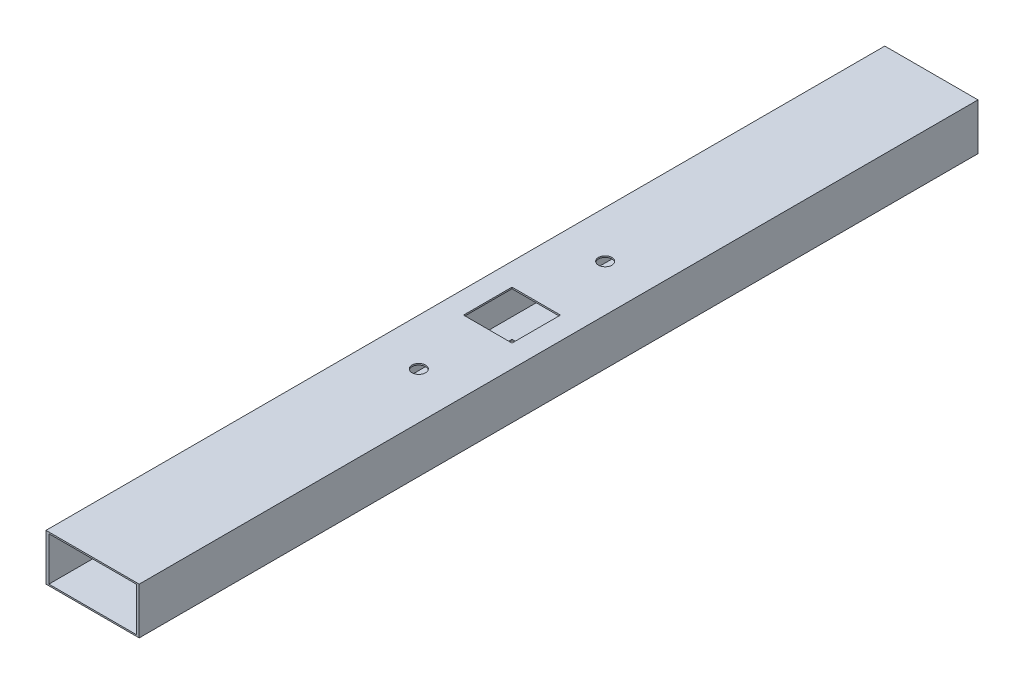
ISO-10303-21;
HEADER;
FILE_DESCRIPTION(('STEP AP214'),'2;1');
FILE_NAME('part.step','',(''),(''),'','','');
FILE_SCHEMA(('AUTOMOTIVE_DESIGN { 1 0 10303 214 1 1 1 1 }'));
ENDSEC;
DATA;
#1=APPLICATION_CONTEXT('core data for automotive mechanical design processes');
#2=APPLICATION_PROTOCOL_DEFINITION('international standard','automotive_design',2000,#1);
#3=PRODUCT_CONTEXT('',#1,'mechanical');
#4=PRODUCT('Part','Part','',(#3));
#5=PRODUCT_RELATED_PRODUCT_CATEGORY('part','',(#4));
#6=PRODUCT_DEFINITION_FORMATION('','',#4);
#7=PRODUCT_DEFINITION_CONTEXT('part definition',#1,'design');
#8=PRODUCT_DEFINITION('design','',#6,#7);
#9=PRODUCT_DEFINITION_SHAPE('','',#8);
#10=(LENGTH_UNIT() NAMED_UNIT(*) SI_UNIT(.MILLI.,.METRE.));
#11=(NAMED_UNIT(*) PLANE_ANGLE_UNIT() SI_UNIT($,.RADIAN.));
#12=(NAMED_UNIT(*) SI_UNIT($,.STERADIAN.) SOLID_ANGLE_UNIT());
#13=UNCERTAINTY_MEASURE_WITH_UNIT(LENGTH_MEASURE(1.E-05),#10,'distance_accuracy_value','');
#14=(GEOMETRIC_REPRESENTATION_CONTEXT(3) GLOBAL_UNCERTAINTY_ASSIGNED_CONTEXT((#13)) GLOBAL_UNIT_ASSIGNED_CONTEXT((#10,
#11,#12)) REPRESENTATION_CONTEXT('',''));
#15=CARTESIAN_POINT('',(0.,0.,0.));
#16=DIRECTION('',(0.,0.,1.));
#17=DIRECTION('',(1.,0.,0.));
#18=AXIS2_PLACEMENT_3D('',#15,#16,#17);
#19=CARTESIAN_POINT('',(0.,0.,457.2));
#20=DIRECTION('',(0.,0.,1.));
#21=DIRECTION('',(1.,0.,0.));
#22=AXIS2_PLACEMENT_3D('',#19,#20,#21);
#23=PLANE('',#22);
#24=DIRECTION('',(0.,1.,0.));
#25=VECTOR('',#24,1.);
#26=CARTESIAN_POINT('',(25.4,12.7,457.2));
#27=LINE('',#26,#25);
#28=CARTESIAN_POINT('',(25.4,-12.7,457.2));
#29=VERTEX_POINT('',#28);
#30=CARTESIAN_POINT('',(25.4,12.7,457.2));
#31=VERTEX_POINT('',#30);
#32=EDGE_CURVE('E238',#29,#31,#27,.T.);
#33=ORIENTED_EDGE('',*,*,#32,.T.);
#34=DIRECTION('',(-1.,0.,0.));
#35=VECTOR('',#34,1.);
#36=CARTESIAN_POINT('',(-25.4,12.7,457.2));
#37=LINE('',#36,#35);
#38=CARTESIAN_POINT('',(-25.4,12.7,457.2));
#39=VERTEX_POINT('',#38);
#40=EDGE_CURVE('E241',#31,#39,#37,.T.);
#41=ORIENTED_EDGE('',*,*,#40,.T.);
#42=DIRECTION('',(0.,-1.,0.));
#43=VECTOR('',#42,1.);
#44=CARTESIAN_POINT('',(-25.4,12.7,457.2));
#45=LINE('',#44,#43);
#46=CARTESIAN_POINT('',(-25.4,-12.7,457.2));
#47=VERTEX_POINT('',#46);
#48=EDGE_CURVE('E244',#39,#47,#45,.T.);
#49=ORIENTED_EDGE('',*,*,#48,.T.);
#50=DIRECTION('',(1.,0.,0.));
#51=VECTOR('',#50,1.);
#52=CARTESIAN_POINT('',(-25.4,-12.7,457.2));
#53=LINE('',#52,#51);
#54=EDGE_CURVE('E246',#47,#29,#53,.T.);
#55=ORIENTED_EDGE('',*,*,#54,.T.);
#56=EDGE_LOOP('',(#33,#41,#49,#55));
#57=FACE_BOUND('',#56,.T.);
#58=DIRECTION('',(-1.,0.,0.));
#59=VECTOR('',#58,1.);
#60=CARTESIAN_POINT('',(-23.8125,11.90625,457.2));
#61=LINE('',#60,#59);
#62=CARTESIAN_POINT('',(23.8125,11.90625,457.2));
#63=VERTEX_POINT('',#62);
#64=CARTESIAN_POINT('',(-23.8125,11.90625,457.2));
#65=VERTEX_POINT('',#64);
#66=EDGE_CURVE('E209',#63,#65,#61,.T.);
#67=ORIENTED_EDGE('',*,*,#66,.F.);
#68=DIRECTION('',(0.,1.,0.));
#69=VECTOR('',#68,1.);
#70=CARTESIAN_POINT('',(23.8125,11.90625,457.2));
#71=LINE('',#70,#69);
#72=CARTESIAN_POINT('',(23.8125,-11.90625,457.2));
#73=VERTEX_POINT('',#72);
#74=EDGE_CURVE('E207',#73,#63,#71,.T.);
#75=ORIENTED_EDGE('',*,*,#74,.F.);
#76=DIRECTION('',(1.,0.,0.));
#77=VECTOR('',#76,1.);
#78=CARTESIAN_POINT('',(-23.8125,-11.90625,457.2));
#79=LINE('',#78,#77);
#80=CARTESIAN_POINT('',(-23.8125,-11.90625,457.2));
#81=VERTEX_POINT('',#80);
#82=EDGE_CURVE('E215',#81,#73,#79,.T.);
#83=ORIENTED_EDGE('',*,*,#82,.F.);
#84=DIRECTION('',(0.,-1.,0.));
#85=VECTOR('',#84,1.);
#86=CARTESIAN_POINT('',(-23.8125,11.90625,457.2));
#87=LINE('',#86,#85);
#88=EDGE_CURVE('E212',#65,#81,#87,.T.);
#89=ORIENTED_EDGE('',*,*,#88,.F.);
#90=EDGE_LOOP('',(#67,#75,#83,#89));
#91=FACE_BOUND('',#90,.T.);
#92=ADVANCED_FACE('F33',(#57,#91),#23,.T.);
#93=CARTESIAN_POINT('',(0.,0.,0.));
#94=DIRECTION('',(0.,0.,1.));
#95=DIRECTION('',(1.,0.,0.));
#96=AXIS2_PLACEMENT_3D('',#93,#94,#95);
#97=PLANE('',#96);
#98=DIRECTION('',(0.,1.,0.));
#99=VECTOR('',#98,1.);
#100=CARTESIAN_POINT('',(25.4,12.7,0.));
#101=LINE('',#100,#99);
#102=CARTESIAN_POINT('',(25.4,-12.7,0.));
#103=VERTEX_POINT('',#102);
#104=CARTESIAN_POINT('',(25.4,12.7,0.));
#105=VERTEX_POINT('',#104);
#106=EDGE_CURVE('E237',#103,#105,#101,.T.);
#107=ORIENTED_EDGE('',*,*,#106,.F.);
#108=DIRECTION('',(1.,0.,0.));
#109=VECTOR('',#108,1.);
#110=CARTESIAN_POINT('',(-25.4,-12.7,0.));
#111=LINE('',#110,#109);
#112=CARTESIAN_POINT('',(-25.4,-12.7,0.));
#113=VERTEX_POINT('',#112);
#114=EDGE_CURVE('E242',#113,#103,#111,.T.);
#115=ORIENTED_EDGE('',*,*,#114,.F.);
#116=DIRECTION('',(0.,-1.,0.));
#117=VECTOR('',#116,1.);
#118=CARTESIAN_POINT('',(-25.4,12.7,0.));
#119=LINE('',#118,#117);
#120=CARTESIAN_POINT('',(-25.4,12.7,0.));
#121=VERTEX_POINT('',#120);
#122=EDGE_CURVE('E253',#121,#113,#119,.T.);
#123=ORIENTED_EDGE('',*,*,#122,.F.);
#124=DIRECTION('',(-1.,0.,0.));
#125=VECTOR('',#124,1.);
#126=CARTESIAN_POINT('',(-25.4,12.7,0.));
#127=LINE('',#126,#125);
#128=EDGE_CURVE('E251',#105,#121,#127,.T.);
#129=ORIENTED_EDGE('',*,*,#128,.F.);
#130=EDGE_LOOP('',(#107,#115,#123,#129));
#131=FACE_BOUND('',#130,.T.);
#132=DIRECTION('',(0.,1.,0.));
#133=VECTOR('',#132,1.);
#134=CARTESIAN_POINT('',(23.8125,11.90625,0.));
#135=LINE('',#134,#133);
#136=CARTESIAN_POINT('',(23.8125,-11.90625,0.));
#137=VERTEX_POINT('',#136);
#138=CARTESIAN_POINT('',(23.8125,11.90625,0.));
#139=VERTEX_POINT('',#138);
#140=EDGE_CURVE('E206',#137,#139,#135,.T.);
#141=ORIENTED_EDGE('',*,*,#140,.T.);
#142=DIRECTION('',(-1.,0.,0.));
#143=VECTOR('',#142,1.);
#144=CARTESIAN_POINT('',(-23.8125,11.90625,0.));
#145=LINE('',#144,#143);
#146=CARTESIAN_POINT('',(-23.8125,11.90625,0.));
#147=VERTEX_POINT('',#146);
#148=EDGE_CURVE('E220',#139,#147,#145,.T.);
#149=ORIENTED_EDGE('',*,*,#148,.T.);
#150=DIRECTION('',(0.,-1.,0.));
#151=VECTOR('',#150,1.);
#152=CARTESIAN_POINT('',(-23.8125,11.90625,0.));
#153=LINE('',#152,#151);
#154=CARTESIAN_POINT('',(-23.8125,-11.90625,0.));
#155=VERTEX_POINT('',#154);
#156=EDGE_CURVE('E223',#147,#155,#153,.T.);
#157=ORIENTED_EDGE('',*,*,#156,.T.);
#158=DIRECTION('',(1.,0.,0.));
#159=VECTOR('',#158,1.);
#160=CARTESIAN_POINT('',(-23.8125,-11.90625,0.));
#161=LINE('',#160,#159);
#162=EDGE_CURVE('E210',#155,#137,#161,.T.);
#163=ORIENTED_EDGE('',*,*,#162,.T.);
#164=EDGE_LOOP('',(#141,#149,#157,#163));
#165=FACE_BOUND('',#164,.T.);
#166=ADVANCED_FACE('F312',(#131,#165),#97,.F.);
#167=CARTESIAN_POINT('',(25.4,12.7,457.2));
#168=DIRECTION('',(-1.,0.,0.));
#169=DIRECTION('',(0.,-1.,0.));
#170=AXIS2_PLACEMENT_3D('',#167,#168,#169);
#171=PLANE('',#170);
#172=ORIENTED_EDGE('',*,*,#106,.T.);
#173=DIRECTION('',(0.,0.,-1.));
#174=VECTOR('',#173,1.);
#175=CARTESIAN_POINT('',(25.4,12.7,457.2));
#176=LINE('',#175,#174);
#177=EDGE_CURVE('E264',#31,#105,#176,.T.);
#178=ORIENTED_EDGE('',*,*,#177,.F.);
#179=ORIENTED_EDGE('',*,*,#32,.F.);
#180=DIRECTION('',(0.,0.,-1.));
#181=VECTOR('',#180,1.);
#182=CARTESIAN_POINT('',(25.4,-12.7,457.2));
#183=LINE('',#182,#181);
#184=EDGE_CURVE('E248',#29,#103,#183,.T.);
#185=ORIENTED_EDGE('',*,*,#184,.T.);
#186=EDGE_LOOP('',(#172,#178,#179,#185));
#187=FACE_BOUND('',#186,.T.);
#188=ADVANCED_FACE('F35',(#187),#171,.F.);
#189=CARTESIAN_POINT('',(-25.4,12.7,457.2));
#190=DIRECTION('',(0.,-1.,0.));
#191=DIRECTION('',(0.,0.,-1.));
#192=AXIS2_PLACEMENT_3D('',#189,#190,#191);
#193=PLANE('',#192);
#194=CARTESIAN_POINT('',(0.,12.7,279.4));
#195=DIRECTION('',(0.,1.,0.));
#196=DIRECTION('',(0.,0.,-1.));
#197=AXIS2_PLACEMENT_3D('',#194,#195,#196);
#198=CIRCLE('',#197,3.68299999999997);
#199=CARTESIAN_POINT('',(0.,12.7,275.717));
#200=VERTEX_POINT('',#199);
#201=EDGE_CURVE('E287',#200,#200,#198,.T.);
#202=ORIENTED_EDGE('',*,*,#201,.F.);
#203=EDGE_LOOP('',(#202));
#204=FACE_BOUND('',#203,.T.);
#205=CARTESIAN_POINT('',(0.,12.7,177.8));
#206=DIRECTION('',(0.,1.,0.));
#207=DIRECTION('',(0.,0.,1.));
#208=AXIS2_PLACEMENT_3D('',#205,#206,#207);
#209=CIRCLE('',#208,3.683);
#210=CARTESIAN_POINT('',(0.,12.7,181.483));
#211=VERTEX_POINT('',#210);
#212=EDGE_CURVE('E278',#211,#211,#209,.T.);
#213=ORIENTED_EDGE('',*,*,#212,.F.);
#214=EDGE_LOOP('',(#213));
#215=FACE_BOUND('',#214,.T.);
#216=DIRECTION('',(-1.,0.,0.));
#217=VECTOR('',#216,1.);
#218=CARTESIAN_POINT('',(-13.208,12.7,215.392));
#219=LINE('',#218,#217);
#220=CARTESIAN_POINT('',(13.208,12.7,215.392));
#221=VERTEX_POINT('',#220);
#222=CARTESIAN_POINT('',(-13.208,12.7,215.392));
#223=VERTEX_POINT('',#222);
#224=EDGE_CURVE('E184',#221,#223,#219,.T.);
#225=ORIENTED_EDGE('',*,*,#224,.F.);
#226=DIRECTION('',(0.,0.,-1.));
#227=VECTOR('',#226,1.);
#228=CARTESIAN_POINT('',(13.208,12.7,215.392));
#229=LINE('',#228,#227);
#230=CARTESIAN_POINT('',(13.208,12.7,241.808));
#231=VERTEX_POINT('',#230);
#232=EDGE_CURVE('E50',#231,#221,#229,.T.);
#233=ORIENTED_EDGE('',*,*,#232,.F.);
#234=DIRECTION('',(1.,0.,0.));
#235=VECTOR('',#234,1.);
#236=CARTESIAN_POINT('',(-13.208,12.7,241.808));
#237=LINE('',#236,#235);
#238=CARTESIAN_POINT('',(-13.208,12.7,241.808));
#239=VERTEX_POINT('',#238);
#240=EDGE_CURVE('E172',#239,#231,#237,.T.);
#241=ORIENTED_EDGE('',*,*,#240,.F.);
#242=DIRECTION('',(0.,0.,1.));
#243=VECTOR('',#242,1.);
#244=CARTESIAN_POINT('',(-13.208,12.7,215.392));
#245=LINE('',#244,#243);
#246=EDGE_CURVE('E175',#223,#239,#245,.T.);
#247=ORIENTED_EDGE('',*,*,#246,.F.);
#248=EDGE_LOOP('',(#225,#233,#241,#247));
#249=FACE_BOUND('',#248,.T.);
#250=ORIENTED_EDGE('',*,*,#128,.T.);
#251=DIRECTION('',(0.,0.,-1.));
#252=VECTOR('',#251,1.);
#253=CARTESIAN_POINT('',(-25.4,12.7,457.2));
#254=LINE('',#253,#252);
#255=EDGE_CURVE('E261',#39,#121,#254,.T.);
#256=ORIENTED_EDGE('',*,*,#255,.F.);
#257=ORIENTED_EDGE('',*,*,#40,.F.);
#258=ORIENTED_EDGE('',*,*,#177,.T.);
#259=EDGE_LOOP('',(#250,#256,#257,#258));
#260=FACE_BOUND('',#259,.T.);
#261=ADVANCED_FACE('F349',(#204,#215,#249,#260),#193,.F.);
#262=CARTESIAN_POINT('',(-25.4,12.7,457.2));
#263=DIRECTION('',(1.,0.,0.));
#264=DIRECTION('',(0.,1.,0.));
#265=AXIS2_PLACEMENT_3D('',#262,#263,#264);
#266=PLANE('',#265);
#267=ORIENTED_EDGE('',*,*,#122,.T.);
#268=DIRECTION('',(0.,0.,-1.));
#269=VECTOR('',#268,1.);
#270=CARTESIAN_POINT('',(-25.4,-12.7,457.2));
#271=LINE('',#270,#269);
#272=EDGE_CURVE('E258',#47,#113,#271,.T.);
#273=ORIENTED_EDGE('',*,*,#272,.F.);
#274=ORIENTED_EDGE('',*,*,#48,.F.);
#275=ORIENTED_EDGE('',*,*,#255,.T.);
#276=EDGE_LOOP('',(#267,#273,#274,#275));
#277=FACE_BOUND('',#276,.T.);
#278=ADVANCED_FACE('F347',(#277),#266,.F.);
#279=CARTESIAN_POINT('',(-25.4,-12.7,457.2));
#280=DIRECTION('',(0.,1.,0.));
#281=DIRECTION('',(0.,0.,1.));
#282=AXIS2_PLACEMENT_3D('',#279,#280,#281);
#283=PLANE('',#282);
#284=CARTESIAN_POINT('',(0.,-12.7,279.4));
#285=DIRECTION('',(0.,1.,0.));
#286=DIRECTION('',(0.,0.,-1.));
#287=AXIS2_PLACEMENT_3D('',#284,#285,#286);
#288=CIRCLE('',#287,3.68299999999997);
#289=CARTESIAN_POINT('',(0.,-12.7,275.717));
#290=VERTEX_POINT('',#289);
#291=EDGE_CURVE('E290',#290,#290,#288,.T.);
#292=ORIENTED_EDGE('',*,*,#291,.T.);
#293=EDGE_LOOP('',(#292));
#294=FACE_BOUND('',#293,.T.);
#295=CARTESIAN_POINT('',(0.,-12.7,177.8));
#296=DIRECTION('',(0.,1.,0.));
#297=DIRECTION('',(0.,0.,1.));
#298=AXIS2_PLACEMENT_3D('',#295,#296,#297);
#299=CIRCLE('',#298,3.683);
#300=CARTESIAN_POINT('',(0.,-12.7,181.483));
#301=VERTEX_POINT('',#300);
#302=EDGE_CURVE('E273',#301,#301,#299,.T.);
#303=ORIENTED_EDGE('',*,*,#302,.T.);
#304=EDGE_LOOP('',(#303));
#305=FACE_BOUND('',#304,.T.);
#306=DIRECTION('',(1.,0.,0.));
#307=VECTOR('',#306,1.);
#308=CARTESIAN_POINT('',(-13.208,-12.7,241.808));
#309=LINE('',#308,#307);
#310=CARTESIAN_POINT('',(-13.208,-12.7,241.808));
#311=VERTEX_POINT('',#310);
#312=CARTESIAN_POINT('',(13.208,-12.7,241.808));
#313=VERTEX_POINT('',#312);
#314=EDGE_CURVE('E171',#311,#313,#309,.T.);
#315=ORIENTED_EDGE('',*,*,#314,.T.);
#316=DIRECTION('',(0.,0.,-1.));
#317=VECTOR('',#316,1.);
#318=CARTESIAN_POINT('',(13.208,-12.7,215.392));
#319=LINE('',#318,#317);
#320=CARTESIAN_POINT('',(13.208,-12.7,215.392));
#321=VERTEX_POINT('',#320);
#322=EDGE_CURVE('E154',#313,#321,#319,.T.);
#323=ORIENTED_EDGE('',*,*,#322,.T.);
#324=DIRECTION('',(-1.,0.,0.));
#325=VECTOR('',#324,1.);
#326=CARTESIAN_POINT('',(-13.208,-12.7,215.392));
#327=LINE('',#326,#325);
#328=CARTESIAN_POINT('',(-13.208,-12.7,215.392));
#329=VERTEX_POINT('',#328);
#330=EDGE_CURVE('E163',#321,#329,#327,.T.);
#331=ORIENTED_EDGE('',*,*,#330,.T.);
#332=DIRECTION('',(0.,0.,1.));
#333=VECTOR('',#332,1.);
#334=CARTESIAN_POINT('',(-13.208,-12.7,215.392));
#335=LINE('',#334,#333);
#336=EDGE_CURVE('E58',#329,#311,#335,.T.);
#337=ORIENTED_EDGE('',*,*,#336,.T.);
#338=EDGE_LOOP('',(#315,#323,#331,#337));
#339=FACE_BOUND('',#338,.T.);
#340=ORIENTED_EDGE('',*,*,#114,.T.);
#341=ORIENTED_EDGE('',*,*,#184,.F.);
#342=ORIENTED_EDGE('',*,*,#54,.F.);
#343=ORIENTED_EDGE('',*,*,#272,.T.);
#344=EDGE_LOOP('',(#340,#341,#342,#343));
#345=FACE_BOUND('',#344,.T.);
#346=ADVANCED_FACE('F168',(#294,#305,#339,#345),#283,.F.);
#347=CARTESIAN_POINT('',(23.8125,11.90625,457.2));
#348=DIRECTION('',(-1.,0.,0.));
#349=DIRECTION('',(0.,0.,1.));
#350=AXIS2_PLACEMENT_3D('',#347,#348,#349);
#351=PLANE('',#350);
#352=ORIENTED_EDGE('',*,*,#140,.F.);
#353=DIRECTION('',(0.,0.,-1.));
#354=VECTOR('',#353,1.);
#355=CARTESIAN_POINT('',(23.8125,-11.90625,457.2));
#356=LINE('',#355,#354);
#357=EDGE_CURVE('E217',#73,#137,#356,.T.);
#358=ORIENTED_EDGE('',*,*,#357,.F.);
#359=ORIENTED_EDGE('',*,*,#74,.T.);
#360=DIRECTION('',(0.,0.,-1.));
#361=VECTOR('',#360,1.);
#362=CARTESIAN_POINT('',(23.8125,11.90625,457.2));
#363=LINE('',#362,#361);
#364=EDGE_CURVE('E234',#63,#139,#363,.T.);
#365=ORIENTED_EDGE('',*,*,#364,.T.);
#366=EDGE_LOOP('',(#352,#358,#359,#365));
#367=FACE_BOUND('',#366,.T.);
#368=ADVANCED_FACE('F321',(#367),#351,.T.);
#369=CARTESIAN_POINT('',(-23.8125,11.90625,457.2));
#370=DIRECTION('',(0.,-1.,0.));
#371=DIRECTION('',(0.,0.,-1.));
#372=AXIS2_PLACEMENT_3D('',#369,#370,#371);
#373=PLANE('',#372);
#374=CARTESIAN_POINT('',(0.,11.90625,279.4));
#375=DIRECTION('',(0.,-1.,0.));
#376=DIRECTION('',(0.,0.,-1.));
#377=AXIS2_PLACEMENT_3D('',#374,#375,#376);
#378=CIRCLE('',#377,3.68299999999997);
#379=CARTESIAN_POINT('',(0.,11.90625,275.717));
#380=VERTEX_POINT('',#379);
#381=EDGE_CURVE('E283',#380,#380,#378,.T.);
#382=ORIENTED_EDGE('',*,*,#381,.F.);
#383=EDGE_LOOP('',(#382));
#384=FACE_BOUND('',#383,.T.);
#385=CARTESIAN_POINT('',(0.,11.90625,177.8));
#386=DIRECTION('',(0.,-1.,0.));
#387=DIRECTION('',(0.,0.,-1.));
#388=AXIS2_PLACEMENT_3D('',#385,#386,#387);
#389=CIRCLE('',#388,3.683);
#390=CARTESIAN_POINT('',(0.,11.90625,174.117));
#391=VERTEX_POINT('',#390);
#392=EDGE_CURVE('E178',#391,#391,#389,.T.);
#393=ORIENTED_EDGE('',*,*,#392,.F.);
#394=EDGE_LOOP('',(#393));
#395=FACE_BOUND('',#394,.T.);
#396=DIRECTION('',(0.,0.,1.));
#397=VECTOR('',#396,1.);
#398=CARTESIAN_POINT('',(13.208,11.90625,457.2));
#399=LINE('',#398,#397);
#400=CARTESIAN_POINT('',(13.208,11.90625,215.392));
#401=VERTEX_POINT('',#400);
#402=CARTESIAN_POINT('',(13.208,11.90625,241.808));
#403=VERTEX_POINT('',#402);
#404=EDGE_CURVE('E204',#401,#403,#399,.T.);
#405=ORIENTED_EDGE('',*,*,#404,.F.);
#406=DIRECTION('',(1.,0.,0.));
#407=VECTOR('',#406,1.);
#408=CARTESIAN_POINT('',(-23.8125,11.90625,215.392));
#409=LINE('',#408,#407);
#410=CARTESIAN_POINT('',(-13.208,11.90625,215.392));
#411=VERTEX_POINT('',#410);
#412=EDGE_CURVE('E191',#411,#401,#409,.T.);
#413=ORIENTED_EDGE('',*,*,#412,.F.);
#414=DIRECTION('',(0.,0.,-1.));
#415=VECTOR('',#414,1.);
#416=CARTESIAN_POINT('',(-13.208,11.90625,457.2));
#417=LINE('',#416,#415);
#418=CARTESIAN_POINT('',(-13.208,11.90625,241.808));
#419=VERTEX_POINT('',#418);
#420=EDGE_CURVE('E199',#419,#411,#417,.T.);
#421=ORIENTED_EDGE('',*,*,#420,.F.);
#422=DIRECTION('',(-1.,0.,0.));
#423=VECTOR('',#422,1.);
#424=CARTESIAN_POINT('',(-23.8125,11.90625,241.808));
#425=LINE('',#424,#423);
#426=EDGE_CURVE('E202',#403,#419,#425,.T.);
#427=ORIENTED_EDGE('',*,*,#426,.F.);
#428=EDGE_LOOP('',(#405,#413,#421,#427));
#429=FACE_BOUND('',#428,.T.);
#430=ORIENTED_EDGE('',*,*,#148,.F.);
#431=ORIENTED_EDGE('',*,*,#364,.F.);
#432=ORIENTED_EDGE('',*,*,#66,.T.);
#433=DIRECTION('',(0.,0.,-1.));
#434=VECTOR('',#433,1.);
#435=CARTESIAN_POINT('',(-23.8125,11.90625,457.2));
#436=LINE('',#435,#434);
#437=EDGE_CURVE('E232',#65,#147,#436,.T.);
#438=ORIENTED_EDGE('',*,*,#437,.T.);
#439=EDGE_LOOP('',(#430,#431,#432,#438));
#440=FACE_BOUND('',#439,.T.);
#441=ADVANCED_FACE('F324',(#384,#395,#429,#440),#373,.T.);
#442=CARTESIAN_POINT('',(-23.8125,11.90625,457.2));
#443=DIRECTION('',(1.,0.,0.));
#444=DIRECTION('',(0.,0.,-1.));
#445=AXIS2_PLACEMENT_3D('',#442,#443,#444);
#446=PLANE('',#445);
#447=ORIENTED_EDGE('',*,*,#156,.F.);
#448=ORIENTED_EDGE('',*,*,#437,.F.);
#449=ORIENTED_EDGE('',*,*,#88,.T.);
#450=DIRECTION('',(0.,0.,-1.));
#451=VECTOR('',#450,1.);
#452=CARTESIAN_POINT('',(-23.8125,-11.90625,457.2));
#453=LINE('',#452,#451);
#454=EDGE_CURVE('E230',#81,#155,#453,.T.);
#455=ORIENTED_EDGE('',*,*,#454,.T.);
#456=EDGE_LOOP('',(#447,#448,#449,#455));
#457=FACE_BOUND('',#456,.T.);
#458=ADVANCED_FACE('F303',(#457),#446,.T.);
#459=CARTESIAN_POINT('',(-23.8125,-11.90625,457.2));
#460=DIRECTION('',(0.,1.,0.));
#461=DIRECTION('',(0.,0.,1.));
#462=AXIS2_PLACEMENT_3D('',#459,#460,#461);
#463=PLANE('',#462);
#464=CARTESIAN_POINT('',(0.,-11.90625,279.4));
#465=DIRECTION('',(0.,1.,0.));
#466=DIRECTION('',(0.,0.,1.));
#467=AXIS2_PLACEMENT_3D('',#464,#465,#466);
#468=CIRCLE('',#467,3.68299999999997);
#469=CARTESIAN_POINT('',(0.,-11.90625,283.083));
#470=VERTEX_POINT('',#469);
#471=EDGE_CURVE('E37',#470,#470,#468,.T.);
#472=ORIENTED_EDGE('',*,*,#471,.F.);
#473=EDGE_LOOP('',(#472));
#474=FACE_BOUND('',#473,.T.);
#475=CARTESIAN_POINT('',(0.,-11.90625,177.8));
#476=DIRECTION('',(0.,1.,0.));
#477=DIRECTION('',(0.,0.,1.));
#478=AXIS2_PLACEMENT_3D('',#475,#476,#477);
#479=CIRCLE('',#478,3.683);
#480=CARTESIAN_POINT('',(0.,-11.90625,181.483));
#481=VERTEX_POINT('',#480);
#482=EDGE_CURVE('E271',#481,#481,#479,.T.);
#483=ORIENTED_EDGE('',*,*,#482,.F.);
#484=EDGE_LOOP('',(#483));
#485=FACE_BOUND('',#484,.T.);
#486=DIRECTION('',(0.,0.,-1.));
#487=VECTOR('',#486,1.);
#488=CARTESIAN_POINT('',(13.208,-11.90625,457.2));
#489=LINE('',#488,#487);
#490=CARTESIAN_POINT('',(13.208,-11.90625,241.808));
#491=VERTEX_POINT('',#490);
#492=CARTESIAN_POINT('',(13.208,-11.90625,215.392));
#493=VERTEX_POINT('',#492);
#494=EDGE_CURVE('E11',#491,#493,#489,.T.);
#495=ORIENTED_EDGE('',*,*,#494,.F.);
#496=DIRECTION('',(1.,0.,0.));
#497=VECTOR('',#496,1.);
#498=CARTESIAN_POINT('',(-23.8125,-11.90625,241.808));
#499=LINE('',#498,#497);
#500=CARTESIAN_POINT('',(-13.208,-11.90625,241.808));
#501=VERTEX_POINT('',#500);
#502=EDGE_CURVE('E42',#501,#491,#499,.T.);
#503=ORIENTED_EDGE('',*,*,#502,.F.);
#504=DIRECTION('',(0.,0.,1.));
#505=VECTOR('',#504,1.);
#506=CARTESIAN_POINT('',(-13.208,-11.90625,457.2));
#507=LINE('',#506,#505);
#508=CARTESIAN_POINT('',(-13.208,-11.90625,215.392));
#509=VERTEX_POINT('',#508);
#510=EDGE_CURVE('E269',#509,#501,#507,.T.);
#511=ORIENTED_EDGE('',*,*,#510,.F.);
#512=DIRECTION('',(-1.,0.,0.));
#513=VECTOR('',#512,1.);
#514=CARTESIAN_POINT('',(-23.8125,-11.90625,215.392));
#515=LINE('',#514,#513);
#516=EDGE_CURVE('E267',#493,#509,#515,.T.);
#517=ORIENTED_EDGE('',*,*,#516,.F.);
#518=EDGE_LOOP('',(#495,#503,#511,#517));
#519=FACE_BOUND('',#518,.T.);
#520=ORIENTED_EDGE('',*,*,#162,.F.);
#521=ORIENTED_EDGE('',*,*,#454,.F.);
#522=ORIENTED_EDGE('',*,*,#82,.T.);
#523=ORIENTED_EDGE('',*,*,#357,.T.);
#524=EDGE_LOOP('',(#520,#521,#522,#523));
#525=FACE_BOUND('',#524,.T.);
#526=ADVANCED_FACE('F300',(#474,#485,#519,#525),#463,.T.);
#527=CARTESIAN_POINT('',(-13.208,-12.7,215.392));
#528=DIRECTION('',(0.,0.,-1.));
#529=DIRECTION('',(-1.,0.,0.));
#530=AXIS2_PLACEMENT_3D('',#527,#528,#529);
#531=PLANE('',#530);
#532=ORIENTED_EDGE('',*,*,#516,.T.);
#533=DIRECTION('',(0.,1.,0.));
#534=VECTOR('',#533,1.);
#535=CARTESIAN_POINT('',(-13.208,-12.7,215.392));
#536=LINE('',#535,#534);
#537=EDGE_CURVE('E165',#329,#509,#536,.T.);
#538=ORIENTED_EDGE('',*,*,#537,.F.);
#539=ORIENTED_EDGE('',*,*,#330,.F.);
#540=DIRECTION('',(0.,1.,0.));
#541=VECTOR('',#540,1.);
#542=CARTESIAN_POINT('',(13.208,-12.7,215.392));
#543=LINE('',#542,#541);
#544=EDGE_CURVE('E149',#321,#493,#543,.T.);
#545=ORIENTED_EDGE('',*,*,#544,.T.);
#546=EDGE_LOOP('',(#532,#538,#539,#545));
#547=FACE_BOUND('',#546,.T.);
#548=ADVANCED_FACE('F164',(#547),#531,.F.);
#549=CARTESIAN_POINT('',(-13.208,-12.7,215.392));
#550=DIRECTION('',(-1.,0.,0.));
#551=DIRECTION('',(0.,0.,1.));
#552=AXIS2_PLACEMENT_3D('',#549,#550,#551);
#553=PLANE('',#552);
#554=ORIENTED_EDGE('',*,*,#510,.T.);
#555=DIRECTION('',(0.,1.,0.));
#556=VECTOR('',#555,1.);
#557=CARTESIAN_POINT('',(-13.208,-12.7,241.808));
#558=LINE('',#557,#556);
#559=EDGE_CURVE('E193',#311,#501,#558,.T.);
#560=ORIENTED_EDGE('',*,*,#559,.F.);
#561=ORIENTED_EDGE('',*,*,#336,.F.);
#562=ORIENTED_EDGE('',*,*,#537,.T.);
#563=EDGE_LOOP('',(#554,#560,#561,#562));
#564=FACE_BOUND('',#563,.T.);
#565=ADVANCED_FACE('F391',(#564),#553,.F.);
#566=CARTESIAN_POINT('',(-13.208,-12.7,241.808));
#567=DIRECTION('',(0.,0.,1.));
#568=DIRECTION('',(1.,0.,0.));
#569=AXIS2_PLACEMENT_3D('',#566,#567,#568);
#570=PLANE('',#569);
#571=ORIENTED_EDGE('',*,*,#502,.T.);
#572=DIRECTION('',(0.,1.,0.));
#573=VECTOR('',#572,1.);
#574=CARTESIAN_POINT('',(13.208,-12.7,241.808));
#575=LINE('',#574,#573);
#576=EDGE_CURVE('E189',#313,#491,#575,.T.);
#577=ORIENTED_EDGE('',*,*,#576,.F.);
#578=ORIENTED_EDGE('',*,*,#314,.F.);
#579=ORIENTED_EDGE('',*,*,#559,.T.);
#580=EDGE_LOOP('',(#571,#577,#578,#579));
#581=FACE_BOUND('',#580,.T.);
#582=ADVANCED_FACE('F399',(#581),#570,.F.);
#583=CARTESIAN_POINT('',(13.208,-12.7,215.392));
#584=DIRECTION('',(1.,0.,0.));
#585=DIRECTION('',(0.,0.,-1.));
#586=AXIS2_PLACEMENT_3D('',#583,#584,#585);
#587=PLANE('',#586);
#588=ORIENTED_EDGE('',*,*,#494,.T.);
#589=ORIENTED_EDGE('',*,*,#544,.F.);
#590=ORIENTED_EDGE('',*,*,#322,.F.);
#591=ORIENTED_EDGE('',*,*,#576,.T.);
#592=EDGE_LOOP('',(#588,#589,#590,#591));
#593=FACE_BOUND('',#592,.T.);
#594=ADVANCED_FACE('F151',(#593),#587,.F.);
#595=ORIENTED_EDGE('',*,*,#404,.T.);
#596=EDGE_CURVE('E192',#403,#231,#575,.T.);
#597=ORIENTED_EDGE('',*,*,#596,.T.);
#598=ORIENTED_EDGE('',*,*,#232,.T.);
#599=EDGE_CURVE('E160',#401,#221,#543,.T.);
#600=ORIENTED_EDGE('',*,*,#599,.F.);
#601=EDGE_LOOP('',(#595,#597,#598,#600));
#602=FACE_BOUND('',#601,.T.);
#603=ADVANCED_FACE('F379',(#602),#587,.F.);
#604=ORIENTED_EDGE('',*,*,#426,.T.);
#605=EDGE_CURVE('E196',#419,#239,#558,.T.);
#606=ORIENTED_EDGE('',*,*,#605,.T.);
#607=ORIENTED_EDGE('',*,*,#240,.T.);
#608=ORIENTED_EDGE('',*,*,#596,.F.);
#609=EDGE_LOOP('',(#604,#606,#607,#608));
#610=FACE_BOUND('',#609,.T.);
#611=ADVANCED_FACE('F386',(#610),#570,.F.);
#612=ORIENTED_EDGE('',*,*,#420,.T.);
#613=EDGE_CURVE('E159',#411,#223,#536,.T.);
#614=ORIENTED_EDGE('',*,*,#613,.T.);
#615=ORIENTED_EDGE('',*,*,#246,.T.);
#616=ORIENTED_EDGE('',*,*,#605,.F.);
#617=EDGE_LOOP('',(#612,#614,#615,#616));
#618=FACE_BOUND('',#617,.T.);
#619=ADVANCED_FACE('F388',(#618),#553,.F.);
#620=ORIENTED_EDGE('',*,*,#412,.T.);
#621=ORIENTED_EDGE('',*,*,#599,.T.);
#622=ORIENTED_EDGE('',*,*,#224,.T.);
#623=ORIENTED_EDGE('',*,*,#613,.F.);
#624=EDGE_LOOP('',(#620,#621,#622,#623));
#625=FACE_BOUND('',#624,.T.);
#626=ADVANCED_FACE('F376',(#625),#531,.F.);
#627=CARTESIAN_POINT('',(0.,-12.7,177.8));
#628=DIRECTION('',(0.,1.,0.));
#629=DIRECTION('',(0.,0.,1.));
#630=AXIS2_PLACEMENT_3D('',#627,#628,#629);
#631=CYLINDRICAL_SURFACE('',#630,3.683);
#632=ORIENTED_EDGE('',*,*,#482,.T.);
#633=EDGE_LOOP('',(#632));
#634=FACE_BOUND('',#633,.T.);
#635=ORIENTED_EDGE('',*,*,#302,.F.);
#636=EDGE_LOOP('',(#635));
#637=FACE_BOUND('',#636,.T.);
#638=ADVANCED_FACE('F396',(#634,#637),#631,.F.);
#639=ORIENTED_EDGE('',*,*,#392,.T.);
#640=EDGE_LOOP('',(#639));
#641=FACE_BOUND('',#640,.T.);
#642=ORIENTED_EDGE('',*,*,#212,.T.);
#643=EDGE_LOOP('',(#642));
#644=FACE_BOUND('',#643,.T.);
#645=ADVANCED_FACE('F439',(#641,#644),#631,.F.);
#646=CARTESIAN_POINT('',(0.,-12.7,279.4));
#647=DIRECTION('',(0.,1.,0.));
#648=DIRECTION('',(0.,0.,1.));
#649=AXIS2_PLACEMENT_3D('',#646,#647,#648);
#650=CYLINDRICAL_SURFACE('',#649,3.68299999999997);
#651=ORIENTED_EDGE('',*,*,#471,.T.);
#652=EDGE_LOOP('',(#651));
#653=FACE_BOUND('',#652,.T.);
#654=ORIENTED_EDGE('',*,*,#291,.F.);
#655=EDGE_LOOP('',(#654));
#656=FACE_BOUND('',#655,.T.);
#657=ADVANCED_FACE('F297',(#653,#656),#650,.F.);
#658=ORIENTED_EDGE('',*,*,#381,.T.);
#659=EDGE_LOOP('',(#658));
#660=FACE_BOUND('',#659,.T.);
#661=ORIENTED_EDGE('',*,*,#201,.T.);
#662=EDGE_LOOP('',(#661));
#663=FACE_BOUND('',#662,.T.);
#664=ADVANCED_FACE('F456',(#660,#663),#650,.F.);
#665=CLOSED_SHELL('',(#92,#166,#188,#261,#278,#346,#368,#441,#458,#526,#548,#565,#582,#594,#603,
#611,#619,#626,#638,#645,#657,#664));
#666=MANIFOLD_SOLID_BREP('B2',#665);
#667=ADVANCED_BREP_SHAPE_REPRESENTATION('',(#18,#666),#14);
#668=SHAPE_DEFINITION_REPRESENTATION(#9,#667);
ENDSEC;
END-ISO-10303-21;
